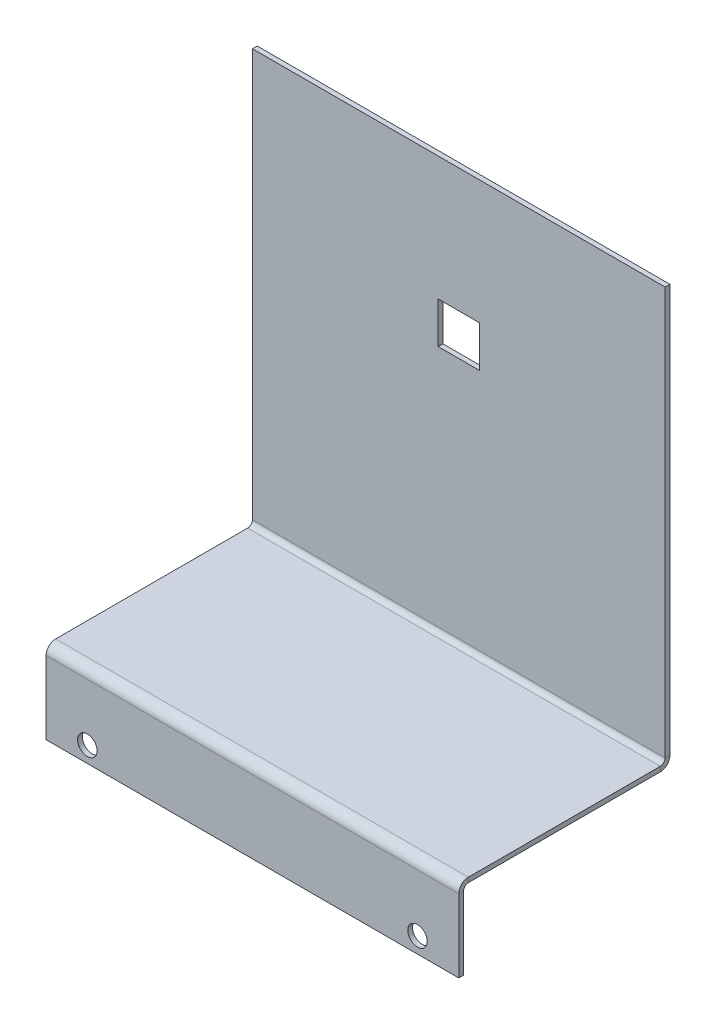
ISO-10303-21;
HEADER;
FILE_DESCRIPTION(('STEP AP214'),'2;1');
FILE_NAME('part.step','',(''),(''),'','','');
FILE_SCHEMA(('AUTOMOTIVE_DESIGN { 1 0 10303 214 1 1 1 1 }'));
ENDSEC;
DATA;
#1=APPLICATION_CONTEXT('core data for automotive mechanical design processes');
#2=APPLICATION_PROTOCOL_DEFINITION('international standard','automotive_design',2000,#1);
#3=PRODUCT_CONTEXT('',#1,'mechanical');
#4=PRODUCT('Part','Part','',(#3));
#5=PRODUCT_RELATED_PRODUCT_CATEGORY('part','',(#4));
#6=PRODUCT_DEFINITION_FORMATION('','',#4);
#7=PRODUCT_DEFINITION_CONTEXT('part definition',#1,'design');
#8=PRODUCT_DEFINITION('design','',#6,#7);
#9=PRODUCT_DEFINITION_SHAPE('','',#8);
#10=(LENGTH_UNIT() NAMED_UNIT(*) SI_UNIT(.MILLI.,.METRE.));
#11=(NAMED_UNIT(*) PLANE_ANGLE_UNIT() SI_UNIT($,.RADIAN.));
#12=(NAMED_UNIT(*) SI_UNIT($,.STERADIAN.) SOLID_ANGLE_UNIT());
#13=UNCERTAINTY_MEASURE_WITH_UNIT(LENGTH_MEASURE(1.E-05),#10,'distance_accuracy_value','');
#14=(GEOMETRIC_REPRESENTATION_CONTEXT(3) GLOBAL_UNCERTAINTY_ASSIGNED_CONTEXT((#13)) GLOBAL_UNIT_ASSIGNED_CONTEXT((#10,
#11,#12)) REPRESENTATION_CONTEXT('',''));
#15=CARTESIAN_POINT('',(0.,0.,0.));
#16=DIRECTION('',(0.,0.,1.));
#17=DIRECTION('',(1.,0.,0.));
#18=AXIS2_PLACEMENT_3D('',#15,#16,#17);
#19=CARTESIAN_POINT('',(63.5,-9.10723684210525,27.4360105263158));
#20=DIRECTION('',(1.,0.,0.));
#21=DIRECTION('',(0.,0.,-1.));
#22=AXIS2_PLACEMENT_3D('',#19,#20,#21);
#23=PLANE('',#22);
#24=DIRECTION('',(0.,-1.,0.));
#25=VECTOR('',#24,1.);
#26=CARTESIAN_POINT('',(63.5,-9.10723684210525,27.4360105263158));
#27=LINE('',#26,#25);
#28=CARTESIAN_POINT('',(63.5,-9.10723684210525,27.4360105263158));
#29=VERTEX_POINT('',#28);
#30=CARTESIAN_POINT('',(63.5,-9.84383684210525,27.4360105263158));
#31=VERTEX_POINT('',#30);
#32=EDGE_CURVE('E11',#29,#31,#27,.T.);
#33=ORIENTED_EDGE('',*,*,#32,.F.);
#34=CARTESIAN_POINT('',(63.5,-10.5804368421053,27.4360105263158));
#35=DIRECTION('',(1.,0.,0.));
#36=DIRECTION('',(0.,0.,-1.));
#37=AXIS2_PLACEMENT_3D('',#34,#35,#36);
#38=CIRCLE('',#37,1.4732);
#39=CARTESIAN_POINT('',(63.5,-10.5804368421053,28.9092105263158));
#40=VERTEX_POINT('',#39);
#41=EDGE_CURVE('E208',#40,#29,#38,.F.);
#42=ORIENTED_EDGE('',*,*,#41,.F.);
#43=DIRECTION('',(0.,0.,1.));
#44=VECTOR('',#43,1.);
#45=CARTESIAN_POINT('',(63.5,-10.5804368421053,28.1726105263158));
#46=LINE('',#45,#44);
#47=CARTESIAN_POINT('',(63.5,-10.5804368421053,28.1726105263158));
#48=VERTEX_POINT('',#47);
#49=EDGE_CURVE('E45',#48,#40,#46,.T.);
#50=ORIENTED_EDGE('',*,*,#49,.F.);
#51=CARTESIAN_POINT('',(63.5,-10.5804368421053,27.4360105263158));
#52=DIRECTION('',(1.,0.,0.));
#53=DIRECTION('',(0.,0.,-1.));
#54=AXIS2_PLACEMENT_3D('',#51,#52,#53);
#55=CIRCLE('',#54,0.7366);
#56=EDGE_CURVE('E220',#48,#31,#55,.F.);
#57=ORIENTED_EDGE('',*,*,#56,.T.);
#58=EDGE_LOOP('',(#33,#42,#50,#57));
#59=FACE_BOUND('',#58,.T.);
#60=ADVANCED_FACE('F37',(#59),#23,.T.);
#61=CARTESIAN_POINT('',(63.5,-10.5804368421053,28.1726105263158));
#62=DIRECTION('',(1.,0.,0.));
#63=DIRECTION('',(0.,0.,-1.));
#64=AXIS2_PLACEMENT_3D('',#61,#62,#63);
#65=PLANE('',#64);
#66=DIRECTION('',(0.,0.,-1.));
#67=VECTOR('',#66,1.);
#68=CARTESIAN_POINT('',(63.5,-9.10723684210525,28.9092105263158));
#69=LINE('',#68,#67);
#70=CARTESIAN_POINT('',(63.5,-9.10723684210525,-2.10418947368422));
#71=VERTEX_POINT('',#70);
#72=EDGE_CURVE('E205',#29,#71,#69,.T.);
#73=ORIENTED_EDGE('',*,*,#72,.F.);
#74=ORIENTED_EDGE('',*,*,#32,.T.);
#75=DIRECTION('',(0.,0.,-1.));
#76=VECTOR('',#75,1.);
#77=CARTESIAN_POINT('',(63.5,-9.84383684210525,28.9092105263158));
#78=LINE('',#77,#76);
#79=CARTESIAN_POINT('',(63.5,-9.84383684210525,-2.10418947368422));
#80=VERTEX_POINT('',#79);
#81=EDGE_CURVE('E223',#31,#80,#78,.T.);
#82=ORIENTED_EDGE('',*,*,#81,.T.);
#83=DIRECTION('',(0.,1.,0.));
#84=VECTOR('',#83,1.);
#85=CARTESIAN_POINT('',(63.5,-9.84383684210525,-2.10418947368422));
#86=LINE('',#85,#84);
#87=EDGE_CURVE('E300',#80,#71,#86,.T.);
#88=ORIENTED_EDGE('',*,*,#87,.T.);
#89=EDGE_LOOP('',(#73,#74,#82,#88));
#90=FACE_BOUND('',#89,.T.);
#91=ADVANCED_FACE('F331',(#90),#65,.T.);
#92=CARTESIAN_POINT('',(0.,-10.5804368421053,28.9092105263158));
#93=DIRECTION('',(-1.,0.,0.));
#94=DIRECTION('',(0.,0.,1.));
#95=AXIS2_PLACEMENT_3D('',#92,#93,#94);
#96=PLANE('',#95);
#97=DIRECTION('',(0.,0.,-1.));
#98=VECTOR('',#97,1.);
#99=CARTESIAN_POINT('',(0.,-10.5804368421053,28.9092105263158));
#100=LINE('',#99,#98);
#101=CARTESIAN_POINT('',(0.,-10.5804368421053,28.9092105263158));
#102=VERTEX_POINT('',#101);
#103=CARTESIAN_POINT('',(0.,-10.5804368421053,28.1726105263158));
#104=VERTEX_POINT('',#103);
#105=EDGE_CURVE('E306',#102,#104,#100,.T.);
#106=ORIENTED_EDGE('',*,*,#105,.F.);
#107=CARTESIAN_POINT('',(0.,-10.5804368421053,27.4360105263158));
#108=DIRECTION('',(1.,0.,0.));
#109=DIRECTION('',(0.,0.,-1.));
#110=AXIS2_PLACEMENT_3D('',#107,#108,#109);
#111=CIRCLE('',#110,1.4732);
#112=CARTESIAN_POINT('',(0.,-9.10723684210525,27.4360105263158));
#113=VERTEX_POINT('',#112);
#114=EDGE_CURVE('E245',#102,#113,#111,.F.);
#115=ORIENTED_EDGE('',*,*,#114,.T.);
#116=DIRECTION('',(0.,1.,0.));
#117=VECTOR('',#116,1.);
#118=CARTESIAN_POINT('',(0.,-9.84383684210525,27.4360105263158));
#119=LINE('',#118,#117);
#120=CARTESIAN_POINT('',(0.,-9.84383684210525,27.4360105263158));
#121=VERTEX_POINT('',#120);
#122=EDGE_CURVE('E304',#121,#113,#119,.T.);
#123=ORIENTED_EDGE('',*,*,#122,.F.);
#124=CARTESIAN_POINT('',(0.,-10.5804368421053,27.4360105263158));
#125=DIRECTION('',(1.,0.,0.));
#126=DIRECTION('',(0.,0.,-1.));
#127=AXIS2_PLACEMENT_3D('',#124,#125,#126);
#128=CIRCLE('',#127,0.7366);
#129=EDGE_CURVE('E257',#104,#121,#128,.F.);
#130=ORIENTED_EDGE('',*,*,#129,.F.);
#131=EDGE_LOOP('',(#106,#115,#123,#130));
#132=FACE_BOUND('',#131,.T.);
#133=ADVANCED_FACE('F336',(#132),#96,.T.);
#134=CARTESIAN_POINT('',(0.,-9.84383684210525,27.4360105263158));
#135=DIRECTION('',(-1.,0.,0.));
#136=DIRECTION('',(0.,0.,1.));
#137=AXIS2_PLACEMENT_3D('',#134,#135,#136);
#138=PLANE('',#137);
#139=DIRECTION('',(0.,1.,0.));
#140=VECTOR('',#139,1.);
#141=CARTESIAN_POINT('',(0.,-21.8072368421053,28.9092105263158));
#142=LINE('',#141,#140);
#143=CARTESIAN_POINT('',(0.,-21.8072368421053,28.9092105263158));
#144=VERTEX_POINT('',#143);
#145=EDGE_CURVE('E248',#144,#102,#142,.T.);
#146=ORIENTED_EDGE('',*,*,#145,.T.);
#147=ORIENTED_EDGE('',*,*,#105,.T.);
#148=DIRECTION('',(0.,1.,0.));
#149=VECTOR('',#148,1.);
#150=CARTESIAN_POINT('',(0.,-21.8072368421053,28.1726105263158));
#151=LINE('',#150,#149);
#152=CARTESIAN_POINT('',(0.,-21.8072368421053,28.1726105263158));
#153=VERTEX_POINT('',#152);
#154=EDGE_CURVE('E254',#153,#104,#151,.T.);
#155=ORIENTED_EDGE('',*,*,#154,.F.);
#156=DIRECTION('',(0.,0.,1.));
#157=VECTOR('',#156,1.);
#158=CARTESIAN_POINT('',(0.,-21.8072368421053,28.1726105263158));
#159=LINE('',#158,#157);
#160=EDGE_CURVE('E251',#153,#144,#159,.T.);
#161=ORIENTED_EDGE('',*,*,#160,.T.);
#162=EDGE_LOOP('',(#146,#147,#155,#161));
#163=FACE_BOUND('',#162,.T.);
#164=ADVANCED_FACE('F390',(#163),#138,.T.);
#165=CARTESIAN_POINT('',(63.5,-8.37063684210525,-2.84078947368422));
#166=DIRECTION('',(1.,0.,0.));
#167=DIRECTION('',(0.,0.,-1.));
#168=AXIS2_PLACEMENT_3D('',#165,#166,#167);
#169=PLANE('',#168);
#170=DIRECTION('',(0.,0.,-1.));
#171=VECTOR('',#170,1.);
#172=CARTESIAN_POINT('',(63.5,-8.37063684210525,-2.84078947368422));
#173=LINE('',#172,#171);
#174=CARTESIAN_POINT('',(63.5,-8.37063684210525,-2.84078947368422));
#175=VERTEX_POINT('',#174);
#176=CARTESIAN_POINT('',(63.5,-8.37063684210525,-3.57738947368422));
#177=VERTEX_POINT('',#176);
#178=EDGE_CURVE('E302',#175,#177,#173,.T.);
#179=ORIENTED_EDGE('',*,*,#178,.F.);
#180=CARTESIAN_POINT('',(63.5,-8.37063684210525,-2.10418947368422));
#181=DIRECTION('',(-1.,0.,0.));
#182=DIRECTION('',(0.,0.,1.));
#183=AXIS2_PLACEMENT_3D('',#180,#181,#182);
#184=CIRCLE('',#183,0.7366);
#185=EDGE_CURVE('E202',#71,#175,#184,.F.);
#186=ORIENTED_EDGE('',*,*,#185,.F.);
#187=ORIENTED_EDGE('',*,*,#87,.F.);
#188=CARTESIAN_POINT('',(63.5,-8.37063684210525,-2.10418947368422));
#189=DIRECTION('',(1.,0.,0.));
#190=DIRECTION('',(0.,0.,-1.));
#191=AXIS2_PLACEMENT_3D('',#188,#189,#190);
#192=CIRCLE('',#191,1.4732);
#193=EDGE_CURVE('E226',#80,#177,#192,.T.);
#194=ORIENTED_EDGE('',*,*,#193,.T.);
#195=EDGE_LOOP('',(#179,#186,#187,#194));
#196=FACE_BOUND('',#195,.T.);
#197=ADVANCED_FACE('F378',(#196),#169,.T.);
#198=CARTESIAN_POINT('',(63.5,-9.84383684210525,-2.10418947368422));
#199=DIRECTION('',(1.,0.,0.));
#200=DIRECTION('',(0.,0.,-1.));
#201=AXIS2_PLACEMENT_3D('',#198,#199,#200);
#202=PLANE('',#201);
#203=DIRECTION('',(0.,1.,0.));
#204=VECTOR('',#203,1.);
#205=CARTESIAN_POINT('',(63.5,-9.10723684210525,-2.84078947368422));
#206=LINE('',#205,#204);
#207=CARTESIAN_POINT('',(63.5,54.3927631578947,-2.84078947368422));
#208=VERTEX_POINT('',#207);
#209=EDGE_CURVE('E199',#175,#208,#206,.T.);
#210=ORIENTED_EDGE('',*,*,#209,.F.);
#211=ORIENTED_EDGE('',*,*,#178,.T.);
#212=DIRECTION('',(0.,1.,0.));
#213=VECTOR('',#212,1.);
#214=CARTESIAN_POINT('',(63.5,-9.10723684210525,-3.57738947368422));
#215=LINE('',#214,#213);
#216=CARTESIAN_POINT('',(63.5,54.3927631578947,-3.57738947368422));
#217=VERTEX_POINT('',#216);
#218=EDGE_CURVE('E193',#177,#217,#215,.T.);
#219=ORIENTED_EDGE('',*,*,#218,.T.);
#220=DIRECTION('',(0.,0.,-1.));
#221=VECTOR('',#220,1.);
#222=CARTESIAN_POINT('',(63.5,54.3927631578947,-2.84078947368422));
#223=LINE('',#222,#221);
#224=EDGE_CURVE('E195',#208,#217,#223,.T.);
#225=ORIENTED_EDGE('',*,*,#224,.F.);
#226=EDGE_LOOP('',(#210,#211,#219,#225));
#227=FACE_BOUND('',#226,.T.);
#228=ADVANCED_FACE('F397',(#227),#202,.T.);
#229=CARTESIAN_POINT('',(0.,-9.10723684210525,-2.10418947368422));
#230=DIRECTION('',(-1.,0.,0.));
#231=DIRECTION('',(0.,0.,1.));
#232=AXIS2_PLACEMENT_3D('',#229,#230,#231);
#233=PLANE('',#232);
#234=DIRECTION('',(0.,-1.,0.));
#235=VECTOR('',#234,1.);
#236=CARTESIAN_POINT('',(0.,-9.10723684210525,-2.10418947368422));
#237=LINE('',#236,#235);
#238=CARTESIAN_POINT('',(0.,-9.10723684210525,-2.10418947368422));
#239=VERTEX_POINT('',#238);
#240=CARTESIAN_POINT('',(0.,-9.84383684210525,-2.10418947368422));
#241=VERTEX_POINT('',#240);
#242=EDGE_CURVE('E298',#239,#241,#237,.T.);
#243=ORIENTED_EDGE('',*,*,#242,.F.);
#244=CARTESIAN_POINT('',(0.,-8.37063684210525,-2.10418947368422));
#245=DIRECTION('',(-1.,0.,0.));
#246=DIRECTION('',(0.,0.,1.));
#247=AXIS2_PLACEMENT_3D('',#244,#245,#246);
#248=CIRCLE('',#247,0.7366);
#249=CARTESIAN_POINT('',(0.,-8.37063684210525,-2.84078947368422));
#250=VERTEX_POINT('',#249);
#251=EDGE_CURVE('E239',#239,#250,#248,.F.);
#252=ORIENTED_EDGE('',*,*,#251,.T.);
#253=DIRECTION('',(0.,0.,1.));
#254=VECTOR('',#253,1.);
#255=CARTESIAN_POINT('',(0.,-8.37063684210525,-3.57738947368422));
#256=LINE('',#255,#254);
#257=CARTESIAN_POINT('',(0.,-8.37063684210525,-3.57738947368422));
#258=VERTEX_POINT('',#257);
#259=EDGE_CURVE('E296',#258,#250,#256,.T.);
#260=ORIENTED_EDGE('',*,*,#259,.F.);
#261=CARTESIAN_POINT('',(0.,-8.37063684210525,-2.10418947368422));
#262=DIRECTION('',(1.,0.,0.));
#263=DIRECTION('',(0.,0.,-1.));
#264=AXIS2_PLACEMENT_3D('',#261,#262,#263);
#265=CIRCLE('',#264,1.4732);
#266=EDGE_CURVE('E196',#241,#258,#265,.T.);
#267=ORIENTED_EDGE('',*,*,#266,.F.);
#268=EDGE_LOOP('',(#243,#252,#260,#267));
#269=FACE_BOUND('',#268,.T.);
#270=ADVANCED_FACE('F403',(#269),#233,.T.);
#271=CARTESIAN_POINT('',(0.,-8.37063684210525,-3.57738947368422));
#272=DIRECTION('',(-1.,0.,0.));
#273=DIRECTION('',(0.,0.,1.));
#274=AXIS2_PLACEMENT_3D('',#271,#272,#273);
#275=PLANE('',#274);
#276=DIRECTION('',(0.,0.,-1.));
#277=VECTOR('',#276,1.);
#278=CARTESIAN_POINT('',(0.,-9.10723684210525,28.9092105263158));
#279=LINE('',#278,#277);
#280=EDGE_CURVE('E242',#113,#239,#279,.T.);
#281=ORIENTED_EDGE('',*,*,#280,.T.);
#282=ORIENTED_EDGE('',*,*,#242,.T.);
#283=DIRECTION('',(0.,0.,-1.));
#284=VECTOR('',#283,1.);
#285=CARTESIAN_POINT('',(0.,-9.84383684210525,28.9092105263158));
#286=LINE('',#285,#284);
#287=EDGE_CURVE('E260',#121,#241,#286,.T.);
#288=ORIENTED_EDGE('',*,*,#287,.F.);
#289=ORIENTED_EDGE('',*,*,#122,.T.);
#290=EDGE_LOOP('',(#281,#282,#288,#289));
#291=FACE_BOUND('',#290,.T.);
#292=ADVANCED_FACE('F387',(#291),#275,.T.);
#293=CARTESIAN_POINT('',(63.5,-9.10723684210525,-3.57738947368422));
#294=DIRECTION('',(0.,0.,1.));
#295=DIRECTION('',(1.,0.,0.));
#296=AXIS2_PLACEMENT_3D('',#293,#294,#295);
#297=PLANE('',#296);
#298=DIRECTION('',(1.,0.,0.));
#299=VECTOR('',#298,1.);
#300=CARTESIAN_POINT('',(28.575,28.9927631578947,-3.57738947368422));
#301=LINE('',#300,#299);
#302=CARTESIAN_POINT('',(28.575,28.9927631578947,-3.57738947368422));
#303=VERTEX_POINT('',#302);
#304=CARTESIAN_POINT('',(34.925,28.9927631578947,-3.57738947368422));
#305=VERTEX_POINT('',#304);
#306=EDGE_CURVE('E158',#303,#305,#301,.T.);
#307=ORIENTED_EDGE('',*,*,#306,.T.);
#308=DIRECTION('',(0.,1.,0.));
#309=VECTOR('',#308,1.);
#310=CARTESIAN_POINT('',(34.925,28.9927631578947,-3.57738947368422));
#311=LINE('',#310,#309);
#312=CARTESIAN_POINT('',(34.925,35.3427631578947,-3.57738947368422));
#313=VERTEX_POINT('',#312);
#314=EDGE_CURVE('E152',#305,#313,#311,.T.);
#315=ORIENTED_EDGE('',*,*,#314,.T.);
#316=DIRECTION('',(-1.,0.,0.));
#317=VECTOR('',#316,1.);
#318=CARTESIAN_POINT('',(28.575,35.3427631578947,-3.57738947368422));
#319=LINE('',#318,#317);
#320=CARTESIAN_POINT('',(28.575,35.3427631578947,-3.57738947368422));
#321=VERTEX_POINT('',#320);
#322=EDGE_CURVE('E161',#313,#321,#319,.T.);
#323=ORIENTED_EDGE('',*,*,#322,.T.);
#324=DIRECTION('',(0.,-1.,0.));
#325=VECTOR('',#324,1.);
#326=CARTESIAN_POINT('',(28.575,28.9927631578947,-3.57738947368422));
#327=LINE('',#326,#325);
#328=EDGE_CURVE('E53',#321,#303,#327,.T.);
#329=ORIENTED_EDGE('',*,*,#328,.T.);
#330=EDGE_LOOP('',(#307,#315,#323,#329));
#331=FACE_BOUND('',#330,.T.);
#332=DIRECTION('',(0.,1.,0.));
#333=VECTOR('',#332,1.);
#334=CARTESIAN_POINT('',(0.,-9.10723684210525,-3.57738947368422));
#335=LINE('',#334,#333);
#336=CARTESIAN_POINT('',(0.,54.3927631578947,-3.57738947368422));
#337=VERTEX_POINT('',#336);
#338=EDGE_CURVE('E230',#258,#337,#335,.T.);
#339=ORIENTED_EDGE('',*,*,#338,.T.);
#340=DIRECTION('',(-1.,0.,0.));
#341=VECTOR('',#340,1.);
#342=CARTESIAN_POINT('',(63.5,54.3927631578947,-3.57738947368422));
#343=LINE('',#342,#341);
#344=EDGE_CURVE('E294',#217,#337,#343,.T.);
#345=ORIENTED_EDGE('',*,*,#344,.F.);
#346=ORIENTED_EDGE('',*,*,#218,.F.);
#347=DIRECTION('',(-1.,0.,0.));
#348=VECTOR('',#347,1.);
#349=CARTESIAN_POINT('',(63.5,-8.37063684210525,-3.57738947368422));
#350=LINE('',#349,#348);
#351=EDGE_CURVE('E229',#177,#258,#350,.T.);
#352=ORIENTED_EDGE('',*,*,#351,.T.);
#353=EDGE_LOOP('',(#339,#345,#346,#352));
#354=FACE_BOUND('',#353,.T.);
#355=ADVANCED_FACE('F165',(#331,#354),#297,.F.);
#356=CARTESIAN_POINT('',(63.5,54.3927631578947,-2.84078947368422));
#357=DIRECTION('',(0.,1.,0.));
#358=DIRECTION('',(0.,0.,1.));
#359=AXIS2_PLACEMENT_3D('',#356,#357,#358);
#360=PLANE('',#359);
#361=DIRECTION('',(0.,0.,-1.));
#362=VECTOR('',#361,1.);
#363=CARTESIAN_POINT('',(0.,54.3927631578947,-2.84078947368422));
#364=LINE('',#363,#362);
#365=CARTESIAN_POINT('',(0.,54.3927631578947,-2.84078947368422));
#366=VERTEX_POINT('',#365);
#367=EDGE_CURVE('E233',#366,#337,#364,.T.);
#368=ORIENTED_EDGE('',*,*,#367,.F.);
#369=DIRECTION('',(-1.,0.,0.));
#370=VECTOR('',#369,1.);
#371=CARTESIAN_POINT('',(63.5,54.3927631578947,-2.84078947368422));
#372=LINE('',#371,#370);
#373=EDGE_CURVE('E292',#208,#366,#372,.T.);
#374=ORIENTED_EDGE('',*,*,#373,.F.);
#375=ORIENTED_EDGE('',*,*,#224,.T.);
#376=ORIENTED_EDGE('',*,*,#344,.T.);
#377=EDGE_LOOP('',(#368,#374,#375,#376));
#378=FACE_BOUND('',#377,.T.);
#379=ADVANCED_FACE('F411',(#378),#360,.T.);
#380=CARTESIAN_POINT('',(63.5,-9.10723684210525,-2.84078947368422));
#381=DIRECTION('',(0.,0.,1.));
#382=DIRECTION('',(1.,0.,0.));
#383=AXIS2_PLACEMENT_3D('',#380,#381,#382);
#384=PLANE('',#383);
#385=DIRECTION('',(0.,1.,0.));
#386=VECTOR('',#385,1.);
#387=CARTESIAN_POINT('',(34.925,28.9927631578947,-2.84078947368422));
#388=LINE('',#387,#386);
#389=CARTESIAN_POINT('',(34.925,28.9927631578947,-2.84078947368422));
#390=VERTEX_POINT('',#389);
#391=CARTESIAN_POINT('',(34.925,35.3427631578947,-2.84078947368422));
#392=VERTEX_POINT('',#391);
#393=EDGE_CURVE('E61',#390,#392,#388,.T.);
#394=ORIENTED_EDGE('',*,*,#393,.F.);
#395=DIRECTION('',(1.,0.,0.));
#396=VECTOR('',#395,1.);
#397=CARTESIAN_POINT('',(28.575,28.9927631578947,-2.84078947368422));
#398=LINE('',#397,#396);
#399=CARTESIAN_POINT('',(28.575,28.9927631578947,-2.84078947368422));
#400=VERTEX_POINT('',#399);
#401=EDGE_CURVE('E168',#400,#390,#398,.T.);
#402=ORIENTED_EDGE('',*,*,#401,.F.);
#403=DIRECTION('',(0.,-1.,0.));
#404=VECTOR('',#403,1.);
#405=CARTESIAN_POINT('',(28.575,28.9927631578947,-2.84078947368422));
#406=LINE('',#405,#404);
#407=CARTESIAN_POINT('',(28.575,35.3427631578947,-2.84078947368422));
#408=VERTEX_POINT('',#407);
#409=EDGE_CURVE('E171',#408,#400,#406,.T.);
#410=ORIENTED_EDGE('',*,*,#409,.F.);
#411=DIRECTION('',(-1.,0.,0.));
#412=VECTOR('',#411,1.);
#413=CARTESIAN_POINT('',(28.575,35.3427631578947,-2.84078947368422));
#414=LINE('',#413,#412);
#415=EDGE_CURVE('E177',#392,#408,#414,.T.);
#416=ORIENTED_EDGE('',*,*,#415,.F.);
#417=EDGE_LOOP('',(#394,#402,#410,#416));
#418=FACE_BOUND('',#417,.T.);
#419=DIRECTION('',(0.,1.,0.));
#420=VECTOR('',#419,1.);
#421=CARTESIAN_POINT('',(0.,-9.10723684210525,-2.84078947368422));
#422=LINE('',#421,#420);
#423=EDGE_CURVE('E236',#250,#366,#422,.T.);
#424=ORIENTED_EDGE('',*,*,#423,.F.);
#425=DIRECTION('',(-1.,0.,0.));
#426=VECTOR('',#425,1.);
#427=CARTESIAN_POINT('',(63.5,-8.37063684210525,-2.84078947368422));
#428=LINE('',#427,#426);
#429=EDGE_CURVE('E289',#175,#250,#428,.T.);
#430=ORIENTED_EDGE('',*,*,#429,.F.);
#431=ORIENTED_EDGE('',*,*,#209,.T.);
#432=ORIENTED_EDGE('',*,*,#373,.T.);
#433=EDGE_LOOP('',(#424,#430,#431,#432));
#434=FACE_BOUND('',#433,.T.);
#435=ADVANCED_FACE('F414',(#418,#434),#384,.T.);
#436=CARTESIAN_POINT('',(63.5,-8.37063684210525,-2.10418947368422));
#437=DIRECTION('',(-1.,0.,0.));
#438=DIRECTION('',(0.,0.,1.));
#439=AXIS2_PLACEMENT_3D('',#436,#437,#438);
#440=CYLINDRICAL_SURFACE('',#439,0.7366);
#441=ORIENTED_EDGE('',*,*,#251,.F.);
#442=DIRECTION('',(-1.,0.,0.));
#443=VECTOR('',#442,1.);
#444=CARTESIAN_POINT('',(63.5,-9.10723684210525,-2.10418947368422));
#445=LINE('',#444,#443);
#446=EDGE_CURVE('E286',#71,#239,#445,.T.);
#447=ORIENTED_EDGE('',*,*,#446,.F.);
#448=ORIENTED_EDGE('',*,*,#185,.T.);
#449=ORIENTED_EDGE('',*,*,#429,.T.);
#450=EDGE_LOOP('',(#441,#447,#448,#449));
#451=FACE_BOUND('',#450,.T.);
#452=ADVANCED_FACE('F383',(#451),#440,.F.);
#453=CARTESIAN_POINT('',(63.5,-9.10723684210525,28.9092105263158));
#454=DIRECTION('',(0.,1.,0.));
#455=DIRECTION('',(0.,0.,1.));
#456=AXIS2_PLACEMENT_3D('',#453,#454,#455);
#457=PLANE('',#456);
#458=ORIENTED_EDGE('',*,*,#280,.F.);
#459=DIRECTION('',(-1.,0.,0.));
#460=VECTOR('',#459,1.);
#461=CARTESIAN_POINT('',(63.5,-9.10723684210525,27.4360105263158));
#462=LINE('',#461,#460);
#463=EDGE_CURVE('E283',#29,#113,#462,.T.);
#464=ORIENTED_EDGE('',*,*,#463,.F.);
#465=ORIENTED_EDGE('',*,*,#72,.T.);
#466=ORIENTED_EDGE('',*,*,#446,.T.);
#467=EDGE_LOOP('',(#458,#464,#465,#466));
#468=FACE_BOUND('',#467,.T.);
#469=ADVANCED_FACE('F345',(#468),#457,.T.);
#470=CARTESIAN_POINT('',(63.5,-10.5804368421053,27.4360105263158));
#471=DIRECTION('',(-1.,0.,0.));
#472=DIRECTION('',(0.,0.,1.));
#473=AXIS2_PLACEMENT_3D('',#470,#471,#472);
#474=CYLINDRICAL_SURFACE('',#473,1.4732);
#475=ORIENTED_EDGE('',*,*,#114,.F.);
#476=DIRECTION('',(-1.,0.,0.));
#477=VECTOR('',#476,1.);
#478=CARTESIAN_POINT('',(63.5,-10.5804368421053,28.9092105263158));
#479=LINE('',#478,#477);
#480=EDGE_CURVE('E280',#40,#102,#479,.T.);
#481=ORIENTED_EDGE('',*,*,#480,.F.);
#482=ORIENTED_EDGE('',*,*,#41,.T.);
#483=ORIENTED_EDGE('',*,*,#463,.T.);
#484=EDGE_LOOP('',(#475,#481,#482,#483));
#485=FACE_BOUND('',#484,.T.);
#486=ADVANCED_FACE('F350',(#485),#474,.T.);
#487=CARTESIAN_POINT('',(63.5,-21.8072368421053,28.9092105263158));
#488=DIRECTION('',(0.,0.,1.));
#489=DIRECTION('',(1.,0.,0.));
#490=AXIS2_PLACEMENT_3D('',#487,#488,#489);
#491=PLANE('',#490);
#492=CARTESIAN_POINT('',(57.15,-19.3688368421053,28.9092105263158));
#493=DIRECTION('',(0.,0.,1.));
#494=DIRECTION('',(1.,0.,0.));
#495=AXIS2_PLACEMENT_3D('',#492,#493,#494);
#496=CIRCLE('',#495,1.5);
#497=CARTESIAN_POINT('',(58.65,-19.3688368421053,28.9092105263158));
#498=VERTEX_POINT('',#497);
#499=EDGE_CURVE('E183',#498,#498,#496,.T.);
#500=ORIENTED_EDGE('',*,*,#499,.F.);
#501=EDGE_LOOP('',(#500));
#502=FACE_BOUND('',#501,.T.);
#503=CARTESIAN_POINT('',(6.35,-19.3688368421053,28.9092105263158));
#504=DIRECTION('',(0.,0.,1.));
#505=DIRECTION('',(1.,0.,0.));
#506=AXIS2_PLACEMENT_3D('',#503,#504,#505);
#507=CIRCLE('',#506,1.5);
#508=CARTESIAN_POINT('',(7.85,-19.3688368421053,28.9092105263158));
#509=VERTEX_POINT('',#508);
#510=EDGE_CURVE('E189',#509,#509,#507,.T.);
#511=ORIENTED_EDGE('',*,*,#510,.F.);
#512=EDGE_LOOP('',(#511));
#513=FACE_BOUND('',#512,.T.);
#514=ORIENTED_EDGE('',*,*,#145,.F.);
#515=DIRECTION('',(-1.,0.,0.));
#516=VECTOR('',#515,1.);
#517=CARTESIAN_POINT('',(63.5,-21.8072368421053,28.9092105263158));
#518=LINE('',#517,#516);
#519=CARTESIAN_POINT('',(63.5,-21.8072368421053,28.9092105263158));
#520=VERTEX_POINT('',#519);
#521=EDGE_CURVE('E278',#520,#144,#518,.T.);
#522=ORIENTED_EDGE('',*,*,#521,.F.);
#523=DIRECTION('',(0.,1.,0.));
#524=VECTOR('',#523,1.);
#525=CARTESIAN_POINT('',(63.5,-21.8072368421053,28.9092105263158));
#526=LINE('',#525,#524);
#527=EDGE_CURVE('E211',#520,#40,#526,.T.);
#528=ORIENTED_EDGE('',*,*,#527,.T.);
#529=ORIENTED_EDGE('',*,*,#480,.T.);
#530=EDGE_LOOP('',(#514,#522,#528,#529));
#531=FACE_BOUND('',#530,.T.);
#532=ADVANCED_FACE('F353',(#502,#513,#531),#491,.T.);
#533=CARTESIAN_POINT('',(63.5,-21.8072368421053,28.1726105263158));
#534=DIRECTION('',(0.,-1.,0.));
#535=DIRECTION('',(0.,0.,-1.));
#536=AXIS2_PLACEMENT_3D('',#533,#534,#535);
#537=PLANE('',#536);
#538=ORIENTED_EDGE('',*,*,#160,.F.);
#539=DIRECTION('',(-1.,0.,0.));
#540=VECTOR('',#539,1.);
#541=CARTESIAN_POINT('',(63.5,-21.8072368421053,28.1726105263158));
#542=LINE('',#541,#540);
#543=CARTESIAN_POINT('',(63.5,-21.8072368421053,28.1726105263158));
#544=VERTEX_POINT('',#543);
#545=EDGE_CURVE('E276',#544,#153,#542,.T.);
#546=ORIENTED_EDGE('',*,*,#545,.F.);
#547=DIRECTION('',(0.,0.,1.));
#548=VECTOR('',#547,1.);
#549=CARTESIAN_POINT('',(63.5,-21.8072368421053,28.1726105263158));
#550=LINE('',#549,#548);
#551=EDGE_CURVE('E214',#544,#520,#550,.T.);
#552=ORIENTED_EDGE('',*,*,#551,.T.);
#553=ORIENTED_EDGE('',*,*,#521,.T.);
#554=EDGE_LOOP('',(#538,#546,#552,#553));
#555=FACE_BOUND('',#554,.T.);
#556=ADVANCED_FACE('F359',(#555),#537,.T.);
#557=CARTESIAN_POINT('',(63.5,-21.8072368421053,28.1726105263158));
#558=DIRECTION('',(0.,0.,1.));
#559=DIRECTION('',(1.,0.,0.));
#560=AXIS2_PLACEMENT_3D('',#557,#558,#559);
#561=PLANE('',#560);
#562=CARTESIAN_POINT('',(57.15,-19.3688368421053,28.1726105263158));
#563=DIRECTION('',(0.,0.,1.));
#564=DIRECTION('',(1.,0.,0.));
#565=AXIS2_PLACEMENT_3D('',#562,#563,#564);
#566=CIRCLE('',#565,1.5);
#567=CARTESIAN_POINT('',(58.65,-19.3688368421053,28.1726105263158));
#568=VERTEX_POINT('',#567);
#569=EDGE_CURVE('E40',#568,#568,#566,.T.);
#570=ORIENTED_EDGE('',*,*,#569,.T.);
#571=EDGE_LOOP('',(#570));
#572=FACE_BOUND('',#571,.T.);
#573=CARTESIAN_POINT('',(6.35,-19.3688368421053,28.1726105263158));
#574=DIRECTION('',(0.,0.,1.));
#575=DIRECTION('',(1.,0.,0.));
#576=AXIS2_PLACEMENT_3D('',#573,#574,#575);
#577=CIRCLE('',#576,1.5);
#578=CARTESIAN_POINT('',(7.85,-19.3688368421053,28.1726105263158));
#579=VERTEX_POINT('',#578);
#580=EDGE_CURVE('E192',#579,#579,#577,.T.);
#581=ORIENTED_EDGE('',*,*,#580,.T.);
#582=EDGE_LOOP('',(#581));
#583=FACE_BOUND('',#582,.T.);
#584=ORIENTED_EDGE('',*,*,#154,.T.);
#585=DIRECTION('',(-1.,0.,0.));
#586=VECTOR('',#585,1.);
#587=CARTESIAN_POINT('',(63.5,-10.5804368421053,28.1726105263158));
#588=LINE('',#587,#586);
#589=EDGE_CURVE('E273',#48,#104,#588,.T.);
#590=ORIENTED_EDGE('',*,*,#589,.F.);
#591=DIRECTION('',(0.,1.,0.));
#592=VECTOR('',#591,1.);
#593=CARTESIAN_POINT('',(63.5,-21.8072368421053,28.1726105263158));
#594=LINE('',#593,#592);
#595=EDGE_CURVE('E217',#544,#48,#594,.T.);
#596=ORIENTED_EDGE('',*,*,#595,.F.);
#597=ORIENTED_EDGE('',*,*,#545,.T.);
#598=EDGE_LOOP('',(#584,#590,#596,#597));
#599=FACE_BOUND('',#598,.T.);
#600=ADVANCED_FACE('F311',(#572,#583,#599),#561,.F.);
#601=CARTESIAN_POINT('',(63.5,-10.5804368421053,27.4360105263158));
#602=DIRECTION('',(-1.,0.,0.));
#603=DIRECTION('',(0.,0.,1.));
#604=AXIS2_PLACEMENT_3D('',#601,#602,#603);
#605=CYLINDRICAL_SURFACE('',#604,0.7366);
#606=ORIENTED_EDGE('',*,*,#129,.T.);
#607=DIRECTION('',(-1.,0.,0.));
#608=VECTOR('',#607,1.);
#609=CARTESIAN_POINT('',(63.5,-9.84383684210525,27.4360105263158));
#610=LINE('',#609,#608);
#611=EDGE_CURVE('E270',#31,#121,#610,.T.);
#612=ORIENTED_EDGE('',*,*,#611,.F.);
#613=ORIENTED_EDGE('',*,*,#56,.F.);
#614=ORIENTED_EDGE('',*,*,#589,.T.);
#615=EDGE_LOOP('',(#606,#612,#613,#614));
#616=FACE_BOUND('',#615,.T.);
#617=ADVANCED_FACE('F365',(#616),#605,.F.);
#618=CARTESIAN_POINT('',(63.5,-9.84383684210525,28.9092105263158));
#619=DIRECTION('',(0.,1.,0.));
#620=DIRECTION('',(0.,0.,1.));
#621=AXIS2_PLACEMENT_3D('',#618,#619,#620);
#622=PLANE('',#621);
#623=ORIENTED_EDGE('',*,*,#287,.T.);
#624=DIRECTION('',(-1.,0.,0.));
#625=VECTOR('',#624,1.);
#626=CARTESIAN_POINT('',(63.5,-9.84383684210525,-2.10418947368422));
#627=LINE('',#626,#625);
#628=EDGE_CURVE('E267',#80,#241,#627,.T.);
#629=ORIENTED_EDGE('',*,*,#628,.F.);
#630=ORIENTED_EDGE('',*,*,#81,.F.);
#631=ORIENTED_EDGE('',*,*,#611,.T.);
#632=EDGE_LOOP('',(#623,#629,#630,#631));
#633=FACE_BOUND('',#632,.T.);
#634=ADVANCED_FACE('F370',(#633),#622,.F.);
#635=CARTESIAN_POINT('',(63.5,-8.37063684210525,-2.10418947368422));
#636=DIRECTION('',(-1.,0.,0.));
#637=DIRECTION('',(0.,0.,1.));
#638=AXIS2_PLACEMENT_3D('',#635,#636,#637);
#639=CYLINDRICAL_SURFACE('',#638,1.4732);
#640=ORIENTED_EDGE('',*,*,#266,.T.);
#641=ORIENTED_EDGE('',*,*,#351,.F.);
#642=ORIENTED_EDGE('',*,*,#193,.F.);
#643=ORIENTED_EDGE('',*,*,#628,.T.);
#644=EDGE_LOOP('',(#640,#641,#642,#643));
#645=FACE_BOUND('',#644,.T.);
#646=ADVANCED_FACE('F375',(#645),#639,.T.);
#647=CARTESIAN_POINT('',(63.5,-8.37063684210525,-2.10418947368422));
#648=DIRECTION('',(-1.,0.,0.));
#649=DIRECTION('',(0.,0.,1.));
#650=AXIS2_PLACEMENT_3D('',#647,#648,#649);
#651=PLANE('',#650);
#652=ORIENTED_EDGE('',*,*,#595,.T.);
#653=ORIENTED_EDGE('',*,*,#49,.T.);
#654=ORIENTED_EDGE('',*,*,#527,.F.);
#655=ORIENTED_EDGE('',*,*,#551,.F.);
#656=EDGE_LOOP('',(#652,#653,#654,#655));
#657=FACE_BOUND('',#656,.T.);
#658=ADVANCED_FACE('F326',(#657),#651,.F.);
#659=CARTESIAN_POINT('',(0.,-8.37063684210525,-2.10418947368422));
#660=DIRECTION('',(-1.,0.,0.));
#661=DIRECTION('',(0.,0.,1.));
#662=AXIS2_PLACEMENT_3D('',#659,#660,#661);
#663=PLANE('',#662);
#664=ORIENTED_EDGE('',*,*,#338,.F.);
#665=ORIENTED_EDGE('',*,*,#259,.T.);
#666=ORIENTED_EDGE('',*,*,#423,.T.);
#667=ORIENTED_EDGE('',*,*,#367,.T.);
#668=EDGE_LOOP('',(#664,#665,#666,#667));
#669=FACE_BOUND('',#668,.T.);
#670=ADVANCED_FACE('F317',(#669),#663,.T.);
#671=CARTESIAN_POINT('',(6.35,-19.3688368421053,-3.57738947368422));
#672=DIRECTION('',(0.,0.,1.));
#673=DIRECTION('',(1.,0.,0.));
#674=AXIS2_PLACEMENT_3D('',#671,#672,#673);
#675=CYLINDRICAL_SURFACE('',#674,1.5);
#676=ORIENTED_EDGE('',*,*,#510,.T.);
#677=EDGE_LOOP('',(#676));
#678=FACE_BOUND('',#677,.T.);
#679=ORIENTED_EDGE('',*,*,#580,.F.);
#680=EDGE_LOOP('',(#679));
#681=FACE_BOUND('',#680,.T.);
#682=ADVANCED_FACE('F314',(#678,#681),#675,.F.);
#683=CARTESIAN_POINT('',(57.15,-19.3688368421053,-3.57738947368422));
#684=DIRECTION('',(0.,0.,1.));
#685=DIRECTION('',(1.,0.,0.));
#686=AXIS2_PLACEMENT_3D('',#683,#684,#685);
#687=CYLINDRICAL_SURFACE('',#686,1.5);
#688=ORIENTED_EDGE('',*,*,#499,.T.);
#689=EDGE_LOOP('',(#688));
#690=FACE_BOUND('',#689,.T.);
#691=ORIENTED_EDGE('',*,*,#569,.F.);
#692=EDGE_LOOP('',(#691));
#693=FACE_BOUND('',#692,.T.);
#694=ADVANCED_FACE('F316',(#690,#693),#687,.F.);
#695=CARTESIAN_POINT('',(34.925,28.9927631578947,-3.57738947368422));
#696=DIRECTION('',(1.,0.,0.));
#697=DIRECTION('',(0.,0.,-1.));
#698=AXIS2_PLACEMENT_3D('',#695,#696,#697);
#699=PLANE('',#698);
#700=ORIENTED_EDGE('',*,*,#393,.T.);
#701=DIRECTION('',(0.,0.,1.));
#702=VECTOR('',#701,1.);
#703=CARTESIAN_POINT('',(34.925,35.3427631578947,-3.57738947368422));
#704=LINE('',#703,#702);
#705=EDGE_CURVE('E148',#313,#392,#704,.T.);
#706=ORIENTED_EDGE('',*,*,#705,.F.);
#707=ORIENTED_EDGE('',*,*,#314,.F.);
#708=DIRECTION('',(0.,0.,1.));
#709=VECTOR('',#708,1.);
#710=CARTESIAN_POINT('',(34.925,28.9927631578947,-3.57738947368422));
#711=LINE('',#710,#709);
#712=EDGE_CURVE('E181',#305,#390,#711,.T.);
#713=ORIENTED_EDGE('',*,*,#712,.T.);
#714=EDGE_LOOP('',(#700,#706,#707,#713));
#715=FACE_BOUND('',#714,.T.);
#716=ADVANCED_FACE('F150',(#715),#699,.F.);
#717=CARTESIAN_POINT('',(28.575,28.9927631578947,-3.57738947368422));
#718=DIRECTION('',(0.,-1.,0.));
#719=DIRECTION('',(0.,0.,-1.));
#720=AXIS2_PLACEMENT_3D('',#717,#718,#719);
#721=PLANE('',#720);
#722=ORIENTED_EDGE('',*,*,#401,.T.);
#723=ORIENTED_EDGE('',*,*,#712,.F.);
#724=ORIENTED_EDGE('',*,*,#306,.F.);
#725=DIRECTION('',(0.,0.,1.));
#726=VECTOR('',#725,1.);
#727=CARTESIAN_POINT('',(28.575,28.9927631578947,-3.57738947368422));
#728=LINE('',#727,#726);
#729=EDGE_CURVE('E184',#303,#400,#728,.T.);
#730=ORIENTED_EDGE('',*,*,#729,.T.);
#731=EDGE_LOOP('',(#722,#723,#724,#730));
#732=FACE_BOUND('',#731,.T.);
#733=ADVANCED_FACE('F501',(#732),#721,.F.);
#734=CARTESIAN_POINT('',(28.575,28.9927631578947,-3.57738947368422));
#735=DIRECTION('',(-1.,0.,0.));
#736=DIRECTION('',(0.,0.,1.));
#737=AXIS2_PLACEMENT_3D('',#734,#735,#736);
#738=PLANE('',#737);
#739=ORIENTED_EDGE('',*,*,#409,.T.);
#740=ORIENTED_EDGE('',*,*,#729,.F.);
#741=ORIENTED_EDGE('',*,*,#328,.F.);
#742=DIRECTION('',(0.,0.,1.));
#743=VECTOR('',#742,1.);
#744=CARTESIAN_POINT('',(28.575,35.3427631578947,-3.57738947368422));
#745=LINE('',#744,#743);
#746=EDGE_CURVE('E157',#321,#408,#745,.T.);
#747=ORIENTED_EDGE('',*,*,#746,.T.);
#748=EDGE_LOOP('',(#739,#740,#741,#747));
#749=FACE_BOUND('',#748,.T.);
#750=ADVANCED_FACE('F511',(#749),#738,.F.);
#751=CARTESIAN_POINT('',(28.575,35.3427631578947,-3.57738947368422));
#752=DIRECTION('',(0.,1.,0.));
#753=DIRECTION('',(0.,0.,1.));
#754=AXIS2_PLACEMENT_3D('',#751,#752,#753);
#755=PLANE('',#754);
#756=ORIENTED_EDGE('',*,*,#415,.T.);
#757=ORIENTED_EDGE('',*,*,#746,.F.);
#758=ORIENTED_EDGE('',*,*,#322,.F.);
#759=ORIENTED_EDGE('',*,*,#705,.T.);
#760=EDGE_LOOP('',(#756,#757,#758,#759));
#761=FACE_BOUND('',#760,.T.);
#762=ADVANCED_FACE('F162',(#761),#755,.F.);
#763=CLOSED_SHELL('',(#60,#91,#133,#164,#197,#228,#270,#292,#355,#379,#435,#452,#469,#486,#532,
#556,#600,#617,#634,#646,#658,#670,#682,#694,#716,#733,#750,#762));
#764=MANIFOLD_SOLID_BREP('B2',#763);
#765=ADVANCED_BREP_SHAPE_REPRESENTATION('',(#18,#764),#14);
#766=SHAPE_DEFINITION_REPRESENTATION(#9,#765);
ENDSEC;
END-ISO-10303-21;
